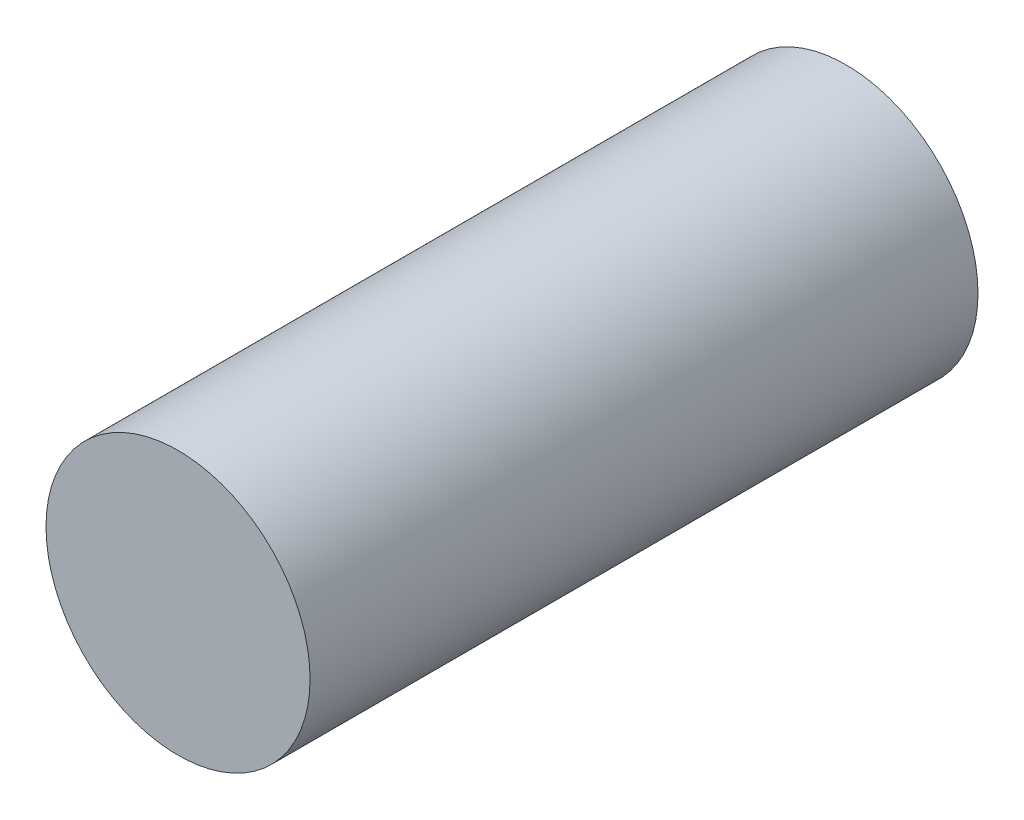
ISO-10303-21;
HEADER;
FILE_DESCRIPTION(('STEP AP214'),'2;1');
FILE_NAME('part.step','',(''),(''),'','','');
FILE_SCHEMA(('AUTOMOTIVE_DESIGN { 1 0 10303 214 1 1 1 1 }'));
ENDSEC;
DATA;
#1=APPLICATION_CONTEXT('core data for automotive mechanical design processes');
#2=APPLICATION_PROTOCOL_DEFINITION('international standard','automotive_design',2000,#1);
#3=PRODUCT_CONTEXT('',#1,'mechanical');
#4=PRODUCT('Part','Part','',(#3));
#5=PRODUCT_RELATED_PRODUCT_CATEGORY('part','',(#4));
#6=PRODUCT_DEFINITION_FORMATION('','',#4);
#7=PRODUCT_DEFINITION_CONTEXT('part definition',#1,'design');
#8=PRODUCT_DEFINITION('design','',#6,#7);
#9=PRODUCT_DEFINITION_SHAPE('','',#8);
#10=(LENGTH_UNIT() NAMED_UNIT(*) SI_UNIT(.MILLI.,.METRE.));
#11=(NAMED_UNIT(*) PLANE_ANGLE_UNIT() SI_UNIT($,.RADIAN.));
#12=(NAMED_UNIT(*) SI_UNIT($,.STERADIAN.) SOLID_ANGLE_UNIT());
#13=UNCERTAINTY_MEASURE_WITH_UNIT(LENGTH_MEASURE(1.E-05),#10,'distance_accuracy_value','');
#14=(GEOMETRIC_REPRESENTATION_CONTEXT(3) GLOBAL_UNCERTAINTY_ASSIGNED_CONTEXT((#13)) GLOBAL_UNIT_ASSIGNED_CONTEXT((#10,
#11,#12)) REPRESENTATION_CONTEXT('',''));
#15=CARTESIAN_POINT('',(0.,0.,0.));
#16=DIRECTION('',(0.,0.,1.));
#17=DIRECTION('',(1.,0.,0.));
#18=AXIS2_PLACEMENT_3D('',#15,#16,#17);
#19=CARTESIAN_POINT('',(0.,0.,43.));
#20=DIRECTION('',(0.,0.,-1.));
#21=DIRECTION('',(-1.,0.,0.));
#22=AXIS2_PLACEMENT_3D('',#19,#20,#21);
#23=CYLINDRICAL_SURFACE('',#22,8.5);
#24=CARTESIAN_POINT('',(0.,0.,43.));
#25=DIRECTION('',(0.,0.,1.));
#26=DIRECTION('',(1.,0.,0.));
#27=AXIS2_PLACEMENT_3D('',#24,#25,#26);
#28=CIRCLE('',#27,8.5);
#29=CARTESIAN_POINT('',(8.5,0.,43.));
#30=VERTEX_POINT('',#29);
#31=EDGE_CURVE('E10',#30,#30,#28,.T.);
#32=ORIENTED_EDGE('',*,*,#31,.F.);
#33=EDGE_LOOP('',(#32));
#34=FACE_BOUND('',#33,.T.);
#35=CARTESIAN_POINT('',(0.,0.,0.));
#36=DIRECTION('',(0.,0.,1.));
#37=DIRECTION('',(1.,0.,0.));
#38=AXIS2_PLACEMENT_3D('',#35,#36,#37);
#39=CIRCLE('',#38,8.5);
#40=CARTESIAN_POINT('',(8.5,0.,0.));
#41=VERTEX_POINT('',#40);
#42=EDGE_CURVE('E34',#41,#41,#39,.T.);
#43=ORIENTED_EDGE('',*,*,#42,.T.);
#44=EDGE_LOOP('',(#43));
#45=FACE_BOUND('',#44,.T.);
#46=ADVANCED_FACE('F31',(#34,#45),#23,.T.);
#47=CARTESIAN_POINT('',(0.,0.,43.));
#48=DIRECTION('',(0.,0.,1.));
#49=DIRECTION('',(1.,0.,0.));
#50=AXIS2_PLACEMENT_3D('',#47,#48,#49);
#51=PLANE('',#50);
#52=ORIENTED_EDGE('',*,*,#31,.T.);
#53=EDGE_LOOP('',(#52));
#54=FACE_BOUND('',#53,.T.);
#55=ADVANCED_FACE('F46',(#54),#51,.T.);
#56=CARTESIAN_POINT('',(0.,0.,0.));
#57=DIRECTION('',(0.,0.,1.));
#58=DIRECTION('',(1.,0.,0.));
#59=AXIS2_PLACEMENT_3D('',#56,#57,#58);
#60=PLANE('',#59);
#61=ORIENTED_EDGE('',*,*,#42,.F.);
#62=EDGE_LOOP('',(#61));
#63=FACE_BOUND('',#62,.T.);
#64=ADVANCED_FACE('F44',(#63),#60,.F.);
#65=CLOSED_SHELL('',(#46,#55,#64));
#66=MANIFOLD_SOLID_BREP('B2',#65);
#67=ADVANCED_BREP_SHAPE_REPRESENTATION('',(#18,#66),#14);
#68=SHAPE_DEFINITION_REPRESENTATION(#9,#67);
ENDSEC;
END-ISO-10303-21;
